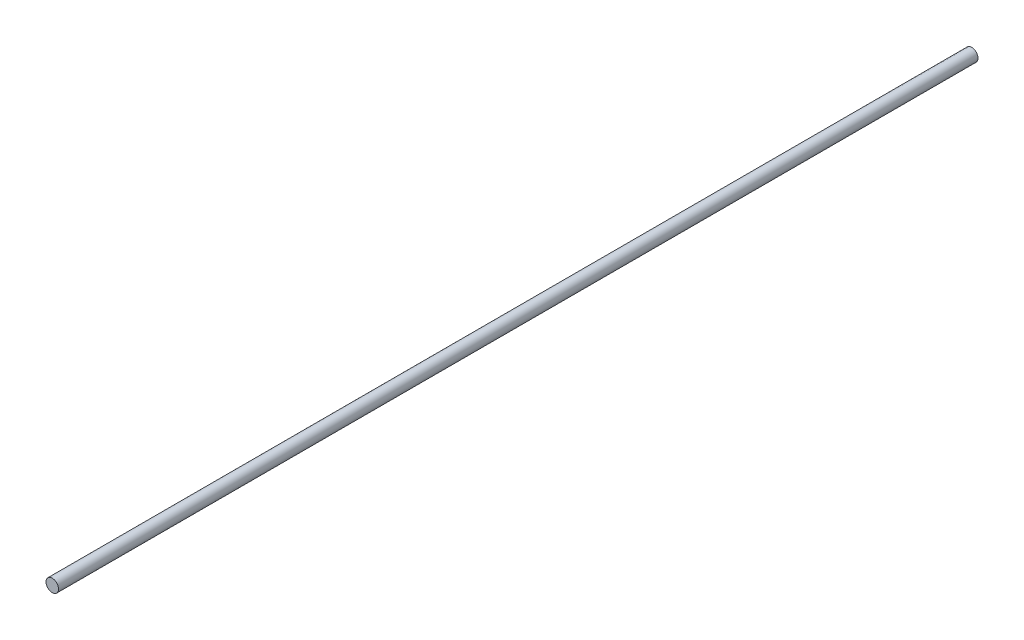
ISO-10303-21;
HEADER;
FILE_DESCRIPTION(('STEP AP214'),'2;1');
FILE_NAME('part.step','',(''),(''),'','','');
FILE_SCHEMA(('AUTOMOTIVE_DESIGN { 1 0 10303 214 1 1 1 1 }'));
ENDSEC;
DATA;
#1=APPLICATION_CONTEXT('core data for automotive mechanical design processes');
#2=APPLICATION_PROTOCOL_DEFINITION('international standard','automotive_design',2000,#1);
#3=PRODUCT_CONTEXT('',#1,'mechanical');
#4=PRODUCT('Part','Part','',(#3));
#5=PRODUCT_RELATED_PRODUCT_CATEGORY('part','',(#4));
#6=PRODUCT_DEFINITION_FORMATION('','',#4);
#7=PRODUCT_DEFINITION_CONTEXT('part definition',#1,'design');
#8=PRODUCT_DEFINITION('design','',#6,#7);
#9=PRODUCT_DEFINITION_SHAPE('','',#8);
#10=(LENGTH_UNIT() NAMED_UNIT(*) SI_UNIT(.MILLI.,.METRE.));
#11=(NAMED_UNIT(*) PLANE_ANGLE_UNIT() SI_UNIT($,.RADIAN.));
#12=(NAMED_UNIT(*) SI_UNIT($,.STERADIAN.) SOLID_ANGLE_UNIT());
#13=UNCERTAINTY_MEASURE_WITH_UNIT(LENGTH_MEASURE(1.E-05),#10,'distance_accuracy_value','');
#14=(GEOMETRIC_REPRESENTATION_CONTEXT(3) GLOBAL_UNCERTAINTY_ASSIGNED_CONTEXT((#13)) GLOBAL_UNIT_ASSIGNED_CONTEXT((#10,
#11,#12)) REPRESENTATION_CONTEXT('',''));
#15=CARTESIAN_POINT('',(0.,0.,0.));
#16=DIRECTION('',(0.,0.,1.));
#17=DIRECTION('',(1.,0.,0.));
#18=AXIS2_PLACEMENT_3D('',#15,#16,#17);
#19=CARTESIAN_POINT('',(0.,0.,733.));
#20=DIRECTION('',(0.,0.,-1.));
#21=DIRECTION('',(-1.,0.,0.));
#22=AXIS2_PLACEMENT_3D('',#19,#20,#21);
#23=CYLINDRICAL_SURFACE('',#22,5.);
#24=CARTESIAN_POINT('',(0.,0.,733.));
#25=DIRECTION('',(0.,0.,1.));
#26=DIRECTION('',(1.,0.,0.));
#27=AXIS2_PLACEMENT_3D('',#24,#25,#26);
#28=CIRCLE('',#27,5.);
#29=CARTESIAN_POINT('',(5.,0.,733.));
#30=VERTEX_POINT('',#29);
#31=EDGE_CURVE('E10',#30,#30,#28,.T.);
#32=ORIENTED_EDGE('',*,*,#31,.F.);
#33=EDGE_LOOP('',(#32));
#34=FACE_BOUND('',#33,.T.);
#35=CARTESIAN_POINT('',(0.,0.,0.));
#36=DIRECTION('',(0.,0.,1.));
#37=DIRECTION('',(1.,0.,0.));
#38=AXIS2_PLACEMENT_3D('',#35,#36,#37);
#39=CIRCLE('',#38,5.);
#40=CARTESIAN_POINT('',(5.,0.,0.));
#41=VERTEX_POINT('',#40);
#42=EDGE_CURVE('E35',#41,#41,#39,.T.);
#43=ORIENTED_EDGE('',*,*,#42,.T.);
#44=EDGE_LOOP('',(#43));
#45=FACE_BOUND('',#44,.T.);
#46=ADVANCED_FACE('F32',(#34,#45),#23,.T.);
#47=CARTESIAN_POINT('',(0.,0.,733.));
#48=DIRECTION('',(0.,0.,1.));
#49=DIRECTION('',(1.,0.,0.));
#50=AXIS2_PLACEMENT_3D('',#47,#48,#49);
#51=PLANE('',#50);
#52=ORIENTED_EDGE('',*,*,#31,.T.);
#53=EDGE_LOOP('',(#52));
#54=FACE_BOUND('',#53,.T.);
#55=ADVANCED_FACE('F47',(#54),#51,.T.);
#56=CARTESIAN_POINT('',(0.,0.,0.));
#57=DIRECTION('',(0.,0.,1.));
#58=DIRECTION('',(1.,0.,0.));
#59=AXIS2_PLACEMENT_3D('',#56,#57,#58);
#60=PLANE('',#59);
#61=ORIENTED_EDGE('',*,*,#42,.F.);
#62=EDGE_LOOP('',(#61));
#63=FACE_BOUND('',#62,.T.);
#64=ADVANCED_FACE('F45',(#63),#60,.F.);
#65=CLOSED_SHELL('',(#46,#55,#64));
#66=MANIFOLD_SOLID_BREP('B2',#65);
#67=ADVANCED_BREP_SHAPE_REPRESENTATION('',(#18,#66),#14);
#68=SHAPE_DEFINITION_REPRESENTATION(#9,#67);
ENDSEC;
END-ISO-10303-21;
